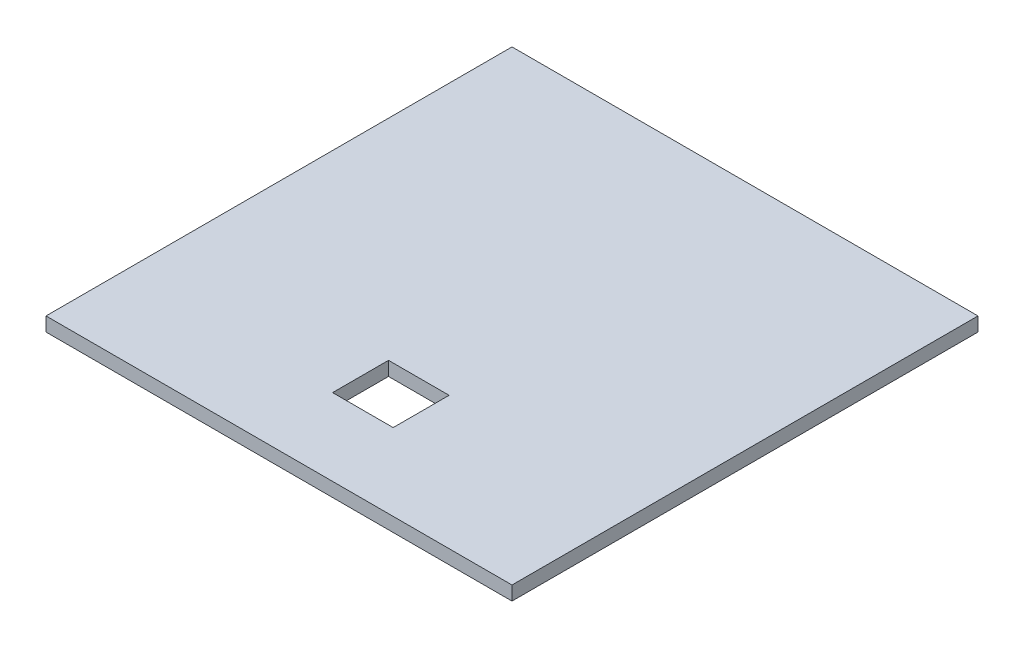
ISO-10303-21;
HEADER;
FILE_DESCRIPTION(('STEP AP214'),'2;1');
FILE_NAME('part.step','',(''),(''),'','','');
FILE_SCHEMA(('AUTOMOTIVE_DESIGN { 1 0 10303 214 1 1 1 1 }'));
ENDSEC;
DATA;
#1=APPLICATION_CONTEXT('core data for automotive mechanical design processes');
#2=APPLICATION_PROTOCOL_DEFINITION('international standard','automotive_design',2000,#1);
#3=PRODUCT_CONTEXT('',#1,'mechanical');
#4=PRODUCT('Part','Part','',(#3));
#5=PRODUCT_RELATED_PRODUCT_CATEGORY('part','',(#4));
#6=PRODUCT_DEFINITION_FORMATION('','',#4);
#7=PRODUCT_DEFINITION_CONTEXT('part definition',#1,'design');
#8=PRODUCT_DEFINITION('design','',#6,#7);
#9=PRODUCT_DEFINITION_SHAPE('','',#8);
#10=(LENGTH_UNIT() NAMED_UNIT(*) SI_UNIT(.MILLI.,.METRE.));
#11=(NAMED_UNIT(*) PLANE_ANGLE_UNIT() SI_UNIT($,.RADIAN.));
#12=(NAMED_UNIT(*) SI_UNIT($,.STERADIAN.) SOLID_ANGLE_UNIT());
#13=UNCERTAINTY_MEASURE_WITH_UNIT(LENGTH_MEASURE(1.E-05),#10,'distance_accuracy_value','');
#14=(GEOMETRIC_REPRESENTATION_CONTEXT(3) GLOBAL_UNCERTAINTY_ASSIGNED_CONTEXT((#13)) GLOBAL_UNIT_ASSIGNED_CONTEXT((#10,
#11,#12)) REPRESENTATION_CONTEXT('',''));
#15=CARTESIAN_POINT('',(0.,0.,0.));
#16=DIRECTION('',(0.,0.,1.));
#17=DIRECTION('',(1.,0.,0.));
#18=AXIS2_PLACEMENT_3D('',#15,#16,#17);
#19=CARTESIAN_POINT('',(-50.,3.,-50.));
#20=DIRECTION('',(1.,0.,0.));
#21=DIRECTION('',(0.,0.,-1.));
#22=AXIS2_PLACEMENT_3D('',#19,#20,#21);
#23=PLANE('',#22);
#24=DIRECTION('',(0.,0.,1.));
#25=VECTOR('',#24,1.);
#26=CARTESIAN_POINT('',(-50.,0.,-50.));
#27=LINE('',#26,#25);
#28=CARTESIAN_POINT('',(-50.,0.,-50.));
#29=VERTEX_POINT('',#28);
#30=CARTESIAN_POINT('',(-50.,0.,50.));
#31=VERTEX_POINT('',#30);
#32=EDGE_CURVE('E144',#29,#31,#27,.T.);
#33=ORIENTED_EDGE('',*,*,#32,.T.);
#34=DIRECTION('',(0.,-1.,0.));
#35=VECTOR('',#34,1.);
#36=CARTESIAN_POINT('',(-50.,3.,50.));
#37=LINE('',#36,#35);
#38=CARTESIAN_POINT('',(-50.,3.,50.));
#39=VERTEX_POINT('',#38);
#40=EDGE_CURVE('E11',#39,#31,#37,.T.);
#41=ORIENTED_EDGE('',*,*,#40,.F.);
#42=DIRECTION('',(0.,0.,1.));
#43=VECTOR('',#42,1.);
#44=CARTESIAN_POINT('',(-50.,3.,-50.));
#45=LINE('',#44,#43);
#46=CARTESIAN_POINT('',(-50.,3.,-50.));
#47=VERTEX_POINT('',#46);
#48=EDGE_CURVE('E146',#47,#39,#45,.T.);
#49=ORIENTED_EDGE('',*,*,#48,.F.);
#50=DIRECTION('',(0.,-1.,0.));
#51=VECTOR('',#50,1.);
#52=CARTESIAN_POINT('',(-50.,3.,-50.));
#53=LINE('',#52,#51);
#54=EDGE_CURVE('E160',#47,#29,#53,.T.);
#55=ORIENTED_EDGE('',*,*,#54,.T.);
#56=EDGE_LOOP('',(#33,#41,#49,#55));
#57=FACE_BOUND('',#56,.T.);
#58=ADVANCED_FACE('F41',(#57),#23,.F.);
#59=CARTESIAN_POINT('',(50.,3.,50.));
#60=DIRECTION('',(0.,0.,-1.));
#61=DIRECTION('',(-1.,0.,0.));
#62=AXIS2_PLACEMENT_3D('',#59,#60,#61);
#63=PLANE('',#62);
#64=DIRECTION('',(1.,0.,0.));
#65=VECTOR('',#64,1.);
#66=CARTESIAN_POINT('',(50.,0.,50.));
#67=LINE('',#66,#65);
#68=CARTESIAN_POINT('',(50.,0.,50.));
#69=VERTEX_POINT('',#68);
#70=EDGE_CURVE('E164',#31,#69,#67,.T.);
#71=ORIENTED_EDGE('',*,*,#70,.T.);
#72=DIRECTION('',(0.,-1.,0.));
#73=VECTOR('',#72,1.);
#74=CARTESIAN_POINT('',(50.,3.,50.));
#75=LINE('',#74,#73);
#76=CARTESIAN_POINT('',(50.,3.,50.));
#77=VERTEX_POINT('',#76);
#78=EDGE_CURVE('E49',#77,#69,#75,.T.);
#79=ORIENTED_EDGE('',*,*,#78,.F.);
#80=DIRECTION('',(1.,0.,0.));
#81=VECTOR('',#80,1.);
#82=CARTESIAN_POINT('',(50.,3.,50.));
#83=LINE('',#82,#81);
#84=EDGE_CURVE('E150',#39,#77,#83,.T.);
#85=ORIENTED_EDGE('',*,*,#84,.F.);
#86=ORIENTED_EDGE('',*,*,#40,.T.);
#87=EDGE_LOOP('',(#71,#79,#85,#86));
#88=FACE_BOUND('',#87,.T.);
#89=ADVANCED_FACE('F198',(#88),#63,.F.);
#90=CARTESIAN_POINT('',(50.,3.,-50.));
#91=DIRECTION('',(-1.,0.,0.));
#92=DIRECTION('',(0.,0.,1.));
#93=AXIS2_PLACEMENT_3D('',#90,#91,#92);
#94=PLANE('',#93);
#95=DIRECTION('',(0.,0.,-1.));
#96=VECTOR('',#95,1.);
#97=CARTESIAN_POINT('',(50.,0.,-50.));
#98=LINE('',#97,#96);
#99=CARTESIAN_POINT('',(50.,0.,-50.));
#100=VERTEX_POINT('',#99);
#101=EDGE_CURVE('E167',#69,#100,#98,.T.);
#102=ORIENTED_EDGE('',*,*,#101,.T.);
#103=DIRECTION('',(0.,-1.,0.));
#104=VECTOR('',#103,1.);
#105=CARTESIAN_POINT('',(50.,3.,-50.));
#106=LINE('',#105,#104);
#107=CARTESIAN_POINT('',(50.,3.,-50.));
#108=VERTEX_POINT('',#107);
#109=EDGE_CURVE('E175',#108,#100,#106,.T.);
#110=ORIENTED_EDGE('',*,*,#109,.F.);
#111=DIRECTION('',(0.,0.,-1.));
#112=VECTOR('',#111,1.);
#113=CARTESIAN_POINT('',(50.,3.,-50.));
#114=LINE('',#113,#112);
#115=EDGE_CURVE('E154',#77,#108,#114,.T.);
#116=ORIENTED_EDGE('',*,*,#115,.F.);
#117=ORIENTED_EDGE('',*,*,#78,.T.);
#118=EDGE_LOOP('',(#102,#110,#116,#117));
#119=FACE_BOUND('',#118,.T.);
#120=ADVANCED_FACE('F184',(#119),#94,.F.);
#121=CARTESIAN_POINT('',(50.,3.,-50.));
#122=DIRECTION('',(0.,0.,1.));
#123=DIRECTION('',(1.,0.,0.));
#124=AXIS2_PLACEMENT_3D('',#121,#122,#123);
#125=PLANE('',#124);
#126=DIRECTION('',(-1.,0.,0.));
#127=VECTOR('',#126,1.);
#128=CARTESIAN_POINT('',(50.,0.,-50.));
#129=LINE('',#128,#127);
#130=EDGE_CURVE('E151',#100,#29,#129,.T.);
#131=ORIENTED_EDGE('',*,*,#130,.T.);
#132=ORIENTED_EDGE('',*,*,#54,.F.);
#133=DIRECTION('',(-1.,0.,0.));
#134=VECTOR('',#133,1.);
#135=CARTESIAN_POINT('',(50.,3.,-50.));
#136=LINE('',#135,#134);
#137=EDGE_CURVE('E157',#108,#47,#136,.T.);
#138=ORIENTED_EDGE('',*,*,#137,.F.);
#139=ORIENTED_EDGE('',*,*,#109,.T.);
#140=EDGE_LOOP('',(#131,#132,#138,#139));
#141=FACE_BOUND('',#140,.T.);
#142=ADVANCED_FACE('F191',(#141),#125,.F.);
#143=CARTESIAN_POINT('',(0.,3.,0.));
#144=DIRECTION('',(0.,-1.,0.));
#145=DIRECTION('',(0.,0.,-1.));
#146=AXIS2_PLACEMENT_3D('',#143,#144,#145);
#147=PLANE('',#146);
#148=DIRECTION('',(-1.,0.,0.));
#149=VECTOR('',#148,1.);
#150=CARTESIAN_POINT('',(-4.99999999999999,3.,33.5));
#151=LINE('',#150,#149);
#152=CARTESIAN_POINT('',(8.00000000000001,3.,33.5));
#153=VERTEX_POINT('',#152);
#154=CARTESIAN_POINT('',(-4.99999999999999,3.,33.5));
#155=VERTEX_POINT('',#154);
#156=EDGE_CURVE('E227',#153,#155,#151,.T.);
#157=ORIENTED_EDGE('',*,*,#156,.T.);
#158=DIRECTION('',(0.,0.,1.));
#159=VECTOR('',#158,1.);
#160=CARTESIAN_POINT('',(-4.99999999999999,3.,33.5));
#161=LINE('',#160,#159);
#162=CARTESIAN_POINT('',(-4.99999999999999,3.,21.5));
#163=VERTEX_POINT('',#162);
#164=EDGE_CURVE('E145',#163,#155,#161,.T.);
#165=ORIENTED_EDGE('',*,*,#164,.F.);
#166=DIRECTION('',(-1.,0.,0.));
#167=VECTOR('',#166,1.);
#168=CARTESIAN_POINT('',(-4.99999999999999,3.,21.5));
#169=LINE('',#168,#167);
#170=CARTESIAN_POINT('',(8.00000000000001,3.,21.5));
#171=VERTEX_POINT('',#170);
#172=EDGE_CURVE('E141',#171,#163,#169,.T.);
#173=ORIENTED_EDGE('',*,*,#172,.F.);
#174=DIRECTION('',(0.,0.,1.));
#175=VECTOR('',#174,1.);
#176=CARTESIAN_POINT('',(8.00000000000001,3.,33.5));
#177=LINE('',#176,#175);
#178=EDGE_CURVE('E112',#171,#153,#177,.T.);
#179=ORIENTED_EDGE('',*,*,#178,.T.);
#180=EDGE_LOOP('',(#157,#165,#173,#179));
#181=FACE_BOUND('',#180,.T.);
#182=ORIENTED_EDGE('',*,*,#48,.T.);
#183=ORIENTED_EDGE('',*,*,#84,.T.);
#184=ORIENTED_EDGE('',*,*,#115,.T.);
#185=ORIENTED_EDGE('',*,*,#137,.T.);
#186=EDGE_LOOP('',(#182,#183,#184,#185));
#187=FACE_BOUND('',#186,.T.);
#188=ADVANCED_FACE('F197',(#181,#187),#147,.F.);
#189=CARTESIAN_POINT('',(0.,0.,0.));
#190=DIRECTION('',(0.,-1.,0.));
#191=DIRECTION('',(0.,0.,-1.));
#192=AXIS2_PLACEMENT_3D('',#189,#190,#191);
#193=PLANE('',#192);
#194=DIRECTION('',(0.,0.,-1.));
#195=VECTOR('',#194,1.);
#196=CARTESIAN_POINT('',(-4.99999999999999,0.,33.5));
#197=LINE('',#196,#195);
#198=CARTESIAN_POINT('',(-4.99999999999999,0.,33.5));
#199=VERTEX_POINT('',#198);
#200=CARTESIAN_POINT('',(-4.99999999999999,0.,21.5));
#201=VERTEX_POINT('',#200);
#202=EDGE_CURVE('E64',#199,#201,#197,.T.);
#203=ORIENTED_EDGE('',*,*,#202,.F.);
#204=DIRECTION('',(1.,0.,0.));
#205=VECTOR('',#204,1.);
#206=CARTESIAN_POINT('',(-4.99999999999999,0.,33.5));
#207=LINE('',#206,#205);
#208=CARTESIAN_POINT('',(8.00000000000001,0.,33.5));
#209=VERTEX_POINT('',#208);
#210=EDGE_CURVE('E127',#199,#209,#207,.T.);
#211=ORIENTED_EDGE('',*,*,#210,.T.);
#212=DIRECTION('',(0.,0.,-1.));
#213=VECTOR('',#212,1.);
#214=CARTESIAN_POINT('',(8.00000000000001,0.,33.5));
#215=LINE('',#214,#213);
#216=CARTESIAN_POINT('',(8.00000000000001,0.,21.5));
#217=VERTEX_POINT('',#216);
#218=EDGE_CURVE('E109',#209,#217,#215,.T.);
#219=ORIENTED_EDGE('',*,*,#218,.T.);
#220=DIRECTION('',(1.,0.,0.));
#221=VECTOR('',#220,1.);
#222=CARTESIAN_POINT('',(-4.99999999999999,0.,21.5));
#223=LINE('',#222,#221);
#224=EDGE_CURVE('E119',#201,#217,#223,.T.);
#225=ORIENTED_EDGE('',*,*,#224,.F.);
#226=EDGE_LOOP('',(#203,#211,#219,#225));
#227=FACE_BOUND('',#226,.T.);
#228=ORIENTED_EDGE('',*,*,#32,.F.);
#229=ORIENTED_EDGE('',*,*,#130,.F.);
#230=ORIENTED_EDGE('',*,*,#101,.F.);
#231=ORIENTED_EDGE('',*,*,#70,.F.);
#232=EDGE_LOOP('',(#228,#229,#230,#231));
#233=FACE_BOUND('',#232,.T.);
#234=ADVANCED_FACE('F124',(#227,#233),#193,.T.);
#235=CARTESIAN_POINT('',(-4.99999999999999,20.6918060129541,33.5));
#236=DIRECTION('',(-1.,0.,0.));
#237=DIRECTION('',(0.,0.,1.));
#238=AXIS2_PLACEMENT_3D('',#235,#236,#237);
#239=PLANE('',#238);
#240=ORIENTED_EDGE('',*,*,#164,.T.);
#241=DIRECTION('',(0.,-1.,0.));
#242=VECTOR('',#241,1.);
#243=CARTESIAN_POINT('',(-4.99999999999999,20.6918060129541,33.5));
#244=LINE('',#243,#242);
#245=EDGE_CURVE('E134',#155,#199,#244,.T.);
#246=ORIENTED_EDGE('',*,*,#245,.T.);
#247=ORIENTED_EDGE('',*,*,#202,.T.);
#248=DIRECTION('',(0.,-1.,0.));
#249=VECTOR('',#248,1.);
#250=CARTESIAN_POINT('',(-4.99999999999999,20.6918060129541,21.5));
#251=LINE('',#250,#249);
#252=EDGE_CURVE('E116',#163,#201,#251,.T.);
#253=ORIENTED_EDGE('',*,*,#252,.F.);
#254=EDGE_LOOP('',(#240,#246,#247,#253));
#255=FACE_BOUND('',#254,.T.);
#256=ADVANCED_FACE('F210',(#255),#239,.F.);
#257=CARTESIAN_POINT('',(-4.99999999999999,20.6918060129541,33.5));
#258=DIRECTION('',(0.,0.,-1.));
#259=DIRECTION('',(-1.,0.,0.));
#260=AXIS2_PLACEMENT_3D('',#257,#258,#259);
#261=PLANE('',#260);
#262=DIRECTION('',(0.,-1.,0.));
#263=VECTOR('',#262,1.);
#264=CARTESIAN_POINT('',(8.00000000000001,20.6918060129541,33.5));
#265=LINE('',#264,#263);
#266=EDGE_CURVE('E115',#153,#209,#265,.T.);
#267=ORIENTED_EDGE('',*,*,#266,.T.);
#268=ORIENTED_EDGE('',*,*,#210,.F.);
#269=ORIENTED_EDGE('',*,*,#245,.F.);
#270=ORIENTED_EDGE('',*,*,#156,.F.);
#271=EDGE_LOOP('',(#267,#268,#269,#270));
#272=FACE_BOUND('',#271,.T.);
#273=ADVANCED_FACE('F216',(#272),#261,.T.);
#274=CARTESIAN_POINT('',(8.00000000000001,20.6918060129541,33.5));
#275=DIRECTION('',(-1.,0.,0.));
#276=DIRECTION('',(0.,0.,1.));
#277=AXIS2_PLACEMENT_3D('',#274,#275,#276);
#278=PLANE('',#277);
#279=DIRECTION('',(0.,-1.,0.));
#280=VECTOR('',#279,1.);
#281=CARTESIAN_POINT('',(8.00000000000001,20.6918060129541,21.5));
#282=LINE('',#281,#280);
#283=EDGE_CURVE('E56',#171,#217,#282,.T.);
#284=ORIENTED_EDGE('',*,*,#283,.T.);
#285=ORIENTED_EDGE('',*,*,#218,.F.);
#286=ORIENTED_EDGE('',*,*,#266,.F.);
#287=ORIENTED_EDGE('',*,*,#178,.F.);
#288=EDGE_LOOP('',(#284,#285,#286,#287));
#289=FACE_BOUND('',#288,.T.);
#290=ADVANCED_FACE('F106',(#289),#278,.T.);
#291=CARTESIAN_POINT('',(-4.99999999999999,20.6918060129541,21.5));
#292=DIRECTION('',(0.,0.,-1.));
#293=DIRECTION('',(-1.,0.,0.));
#294=AXIS2_PLACEMENT_3D('',#291,#292,#293);
#295=PLANE('',#294);
#296=ORIENTED_EDGE('',*,*,#172,.T.);
#297=ORIENTED_EDGE('',*,*,#252,.T.);
#298=ORIENTED_EDGE('',*,*,#224,.T.);
#299=ORIENTED_EDGE('',*,*,#283,.F.);
#300=EDGE_LOOP('',(#296,#297,#298,#299));
#301=FACE_BOUND('',#300,.T.);
#302=ADVANCED_FACE('F120',(#301),#295,.F.);
#303=CLOSED_SHELL('',(#58,#89,#120,#142,#188,#234,#256,#273,#290,#302));
#304=MANIFOLD_SOLID_BREP('B2',#303);
#305=ADVANCED_BREP_SHAPE_REPRESENTATION('',(#18,#304),#14);
#306=SHAPE_DEFINITION_REPRESENTATION(#9,#305);
ENDSEC;
END-ISO-10303-21;
